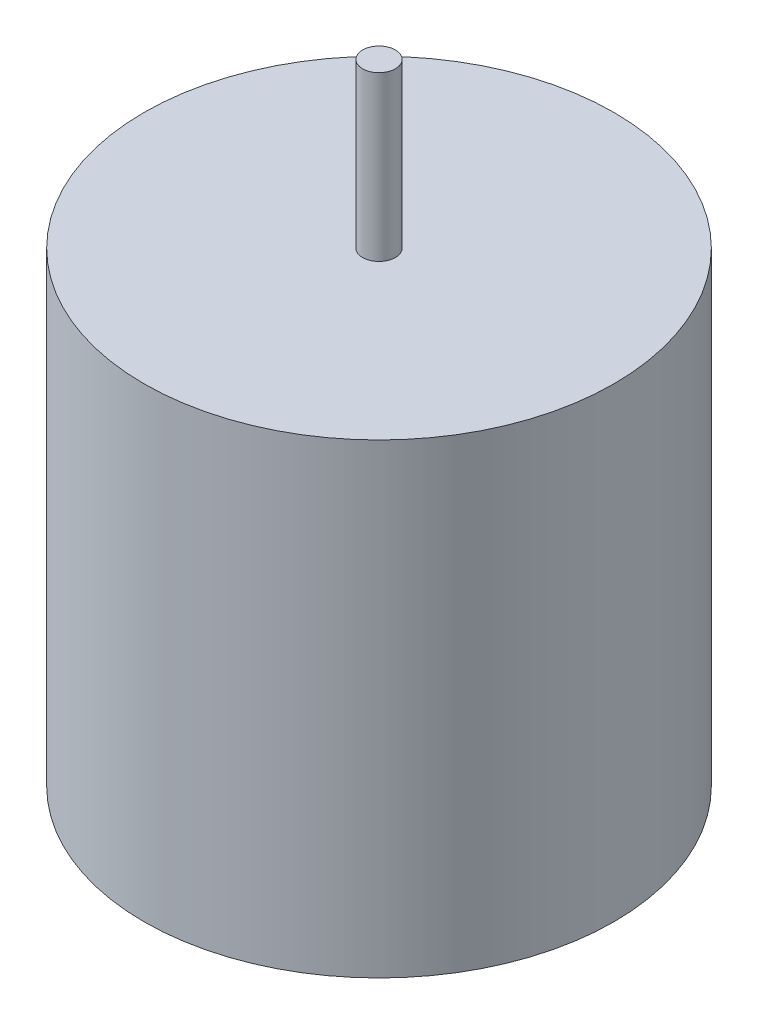
ISO-10303-21;
HEADER;
FILE_DESCRIPTION(('STEP AP214'),'2;1');
FILE_NAME('part.step','',(''),(''),'','','');
FILE_SCHEMA(('AUTOMOTIVE_DESIGN { 1 0 10303 214 1 1 1 1 }'));
ENDSEC;
DATA;
#1=APPLICATION_CONTEXT('core data for automotive mechanical design processes');
#2=APPLICATION_PROTOCOL_DEFINITION('international standard','automotive_design',2000,#1);
#3=PRODUCT_CONTEXT('',#1,'mechanical');
#4=PRODUCT('Part','Part','',(#3));
#5=PRODUCT_RELATED_PRODUCT_CATEGORY('part','',(#4));
#6=PRODUCT_DEFINITION_FORMATION('','',#4);
#7=PRODUCT_DEFINITION_CONTEXT('part definition',#1,'design');
#8=PRODUCT_DEFINITION('design','',#6,#7);
#9=PRODUCT_DEFINITION_SHAPE('','',#8);
#10=(LENGTH_UNIT() NAMED_UNIT(*) SI_UNIT(.MILLI.,.METRE.));
#11=(NAMED_UNIT(*) PLANE_ANGLE_UNIT() SI_UNIT($,.RADIAN.));
#12=(NAMED_UNIT(*) SI_UNIT($,.STERADIAN.) SOLID_ANGLE_UNIT());
#13=UNCERTAINTY_MEASURE_WITH_UNIT(LENGTH_MEASURE(1.E-05),#10,'distance_accuracy_value','');
#14=(GEOMETRIC_REPRESENTATION_CONTEXT(3) GLOBAL_UNCERTAINTY_ASSIGNED_CONTEXT((#13)) GLOBAL_UNIT_ASSIGNED_CONTEXT((#10,
#11,#12)) REPRESENTATION_CONTEXT('',''));
#15=CARTESIAN_POINT('',(0.,0.,0.));
#16=DIRECTION('',(0.,0.,1.));
#17=DIRECTION('',(1.,0.,0.));
#18=AXIS2_PLACEMENT_3D('',#15,#16,#17);
#19=CARTESIAN_POINT('',(0.,40.,0.));
#20=DIRECTION('',(0.,-1.,0.));
#21=DIRECTION('',(0.,0.,-1.));
#22=AXIS2_PLACEMENT_3D('',#19,#20,#21);
#23=CYLINDRICAL_SURFACE('',#22,4.);
#24=CARTESIAN_POINT('',(0.,40.,0.));
#25=DIRECTION('',(0.,1.,0.));
#26=DIRECTION('',(0.,0.,1.));
#27=AXIS2_PLACEMENT_3D('',#24,#25,#26);
#28=CIRCLE('',#27,4.);
#29=CARTESIAN_POINT('',(0.,40.,4.));
#30=VERTEX_POINT('',#29);
#31=EDGE_CURVE('E10',#30,#30,#28,.T.);
#32=ORIENTED_EDGE('',*,*,#31,.F.);
#33=EDGE_LOOP('',(#32));
#34=FACE_BOUND('',#33,.T.);
#35=CARTESIAN_POINT('',(0.,0.,0.));
#36=DIRECTION('',(0.,1.,0.));
#37=DIRECTION('',(0.,0.,1.));
#38=AXIS2_PLACEMENT_3D('',#35,#36,#37);
#39=CIRCLE('',#38,4.);
#40=CARTESIAN_POINT('',(0.,0.,4.));
#41=VERTEX_POINT('',#40);
#42=EDGE_CURVE('E34',#41,#41,#39,.T.);
#43=ORIENTED_EDGE('',*,*,#42,.T.);
#44=EDGE_LOOP('',(#43));
#45=FACE_BOUND('',#44,.T.);
#46=ADVANCED_FACE('F31',(#34,#45),#23,.T.);
#47=CARTESIAN_POINT('',(0.,40.,0.));
#48=DIRECTION('',(0.,1.,0.));
#49=DIRECTION('',(0.,0.,1.));
#50=AXIS2_PLACEMENT_3D('',#47,#48,#49);
#51=PLANE('',#50);
#52=ORIENTED_EDGE('',*,*,#31,.T.);
#53=EDGE_LOOP('',(#52));
#54=FACE_BOUND('',#53,.T.);
#55=ADVANCED_FACE('F54',(#54),#51,.T.);
#56=CARTESIAN_POINT('',(0.,-114.,0.));
#57=DIRECTION('',(0.,1.,0.));
#58=DIRECTION('',(0.,0.,1.));
#59=AXIS2_PLACEMENT_3D('',#56,#57,#58);
#60=CYLINDRICAL_SURFACE('',#59,57.5);
#61=CARTESIAN_POINT('',(0.,-114.,0.));
#62=DIRECTION('',(0.,-1.,0.));
#63=DIRECTION('',(0.,0.,-1.));
#64=AXIS2_PLACEMENT_3D('',#61,#62,#63);
#65=CIRCLE('',#64,57.5);
#66=CARTESIAN_POINT('',(0.,-114.,-57.5));
#67=VERTEX_POINT('',#66);
#68=EDGE_CURVE('E41',#67,#67,#65,.T.);
#69=ORIENTED_EDGE('',*,*,#68,.F.);
#70=EDGE_LOOP('',(#69));
#71=FACE_BOUND('',#70,.T.);
#72=CARTESIAN_POINT('',(0.,0.,0.));
#73=DIRECTION('',(0.,-1.,0.));
#74=DIRECTION('',(0.,0.,-1.));
#75=AXIS2_PLACEMENT_3D('',#72,#73,#74);
#76=CIRCLE('',#75,57.5);
#77=CARTESIAN_POINT('',(0.,0.,-57.5));
#78=VERTEX_POINT('',#77);
#79=EDGE_CURVE('E43',#78,#78,#76,.T.);
#80=ORIENTED_EDGE('',*,*,#79,.T.);
#81=EDGE_LOOP('',(#80));
#82=FACE_BOUND('',#81,.T.);
#83=ADVANCED_FACE('F51',(#71,#82),#60,.T.);
#84=CARTESIAN_POINT('',(0.,-114.,0.));
#85=DIRECTION('',(0.,-1.,0.));
#86=DIRECTION('',(0.,0.,-1.));
#87=AXIS2_PLACEMENT_3D('',#84,#85,#86);
#88=PLANE('',#87);
#89=ORIENTED_EDGE('',*,*,#68,.T.);
#90=EDGE_LOOP('',(#89));
#91=FACE_BOUND('',#90,.T.);
#92=ADVANCED_FACE('F49',(#91),#88,.T.);
#93=CARTESIAN_POINT('',(0.,0.,0.));
#94=DIRECTION('',(0.,-1.,0.));
#95=DIRECTION('',(0.,0.,-1.));
#96=AXIS2_PLACEMENT_3D('',#93,#94,#95);
#97=PLANE('',#96);
#98=ORIENTED_EDGE('',*,*,#42,.F.);
#99=EDGE_LOOP('',(#98));
#100=FACE_BOUND('',#99,.T.);
#101=ORIENTED_EDGE('',*,*,#79,.F.);
#102=EDGE_LOOP('',(#101));
#103=FACE_BOUND('',#102,.T.);
#104=ADVANCED_FACE('F58',(#100,#103),#97,.F.);
#105=CLOSED_SHELL('',(#46,#55,#83,#92,#104));
#106=MANIFOLD_SOLID_BREP('B2',#105);
#107=ADVANCED_BREP_SHAPE_REPRESENTATION('',(#18,#106),#14);
#108=SHAPE_DEFINITION_REPRESENTATION(#9,#107);
ENDSEC;
END-ISO-10303-21;
